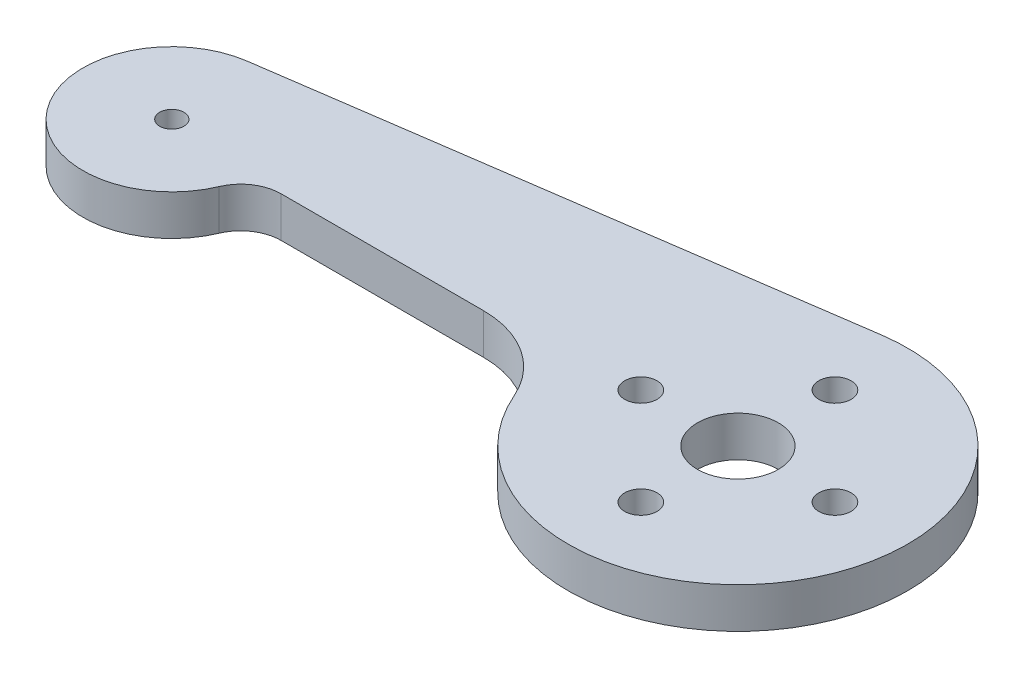
ISO-10303-21;
HEADER;
FILE_DESCRIPTION(('STEP AP214'),'2;1');
FILE_NAME('part.step','',(''),(''),'','','');
FILE_SCHEMA(('AUTOMOTIVE_DESIGN { 1 0 10303 214 1 1 1 1 }'));
ENDSEC;
DATA;
#1=APPLICATION_CONTEXT('core data for automotive mechanical design processes');
#2=APPLICATION_PROTOCOL_DEFINITION('international standard','automotive_design',2000,#1);
#3=PRODUCT_CONTEXT('',#1,'mechanical');
#4=PRODUCT('Part','Part','',(#3));
#5=PRODUCT_RELATED_PRODUCT_CATEGORY('part','',(#4));
#6=PRODUCT_DEFINITION_FORMATION('','',#4);
#7=PRODUCT_DEFINITION_CONTEXT('part definition',#1,'design');
#8=PRODUCT_DEFINITION('design','',#6,#7);
#9=PRODUCT_DEFINITION_SHAPE('','',#8);
#10=(LENGTH_UNIT() NAMED_UNIT(*) SI_UNIT(.MILLI.,.METRE.));
#11=(NAMED_UNIT(*) PLANE_ANGLE_UNIT() SI_UNIT($,.RADIAN.));
#12=(NAMED_UNIT(*) SI_UNIT($,.STERADIAN.) SOLID_ANGLE_UNIT());
#13=UNCERTAINTY_MEASURE_WITH_UNIT(LENGTH_MEASURE(1.E-05),#10,'distance_accuracy_value','');
#14=(GEOMETRIC_REPRESENTATION_CONTEXT(3) GLOBAL_UNCERTAINTY_ASSIGNED_CONTEXT((#13)) GLOBAL_UNIT_ASSIGNED_CONTEXT((#10,
#11,#12)) REPRESENTATION_CONTEXT('',''));
#15=CARTESIAN_POINT('',(0.,0.,0.));
#16=DIRECTION('',(0.,0.,1.));
#17=DIRECTION('',(1.,0.,0.));
#18=AXIS2_PLACEMENT_3D('',#15,#16,#17);
#19=CARTESIAN_POINT('',(0.,5.,0.));
#20=DIRECTION('',(0.,1.,0.));
#21=DIRECTION('',(0.,0.,1.));
#22=AXIS2_PLACEMENT_3D('',#19,#20,#21);
#23=PLANE('',#22);
#24=CARTESIAN_POINT('',(70.,5.,12.));
#25=DIRECTION('',(0.,1.,0.));
#26=DIRECTION('',(0.,0.,1.));
#27=AXIS2_PLACEMENT_3D('',#24,#25,#26);
#28=CIRCLE('',#27,2.);
#29=CARTESIAN_POINT('',(70.,5.,14.));
#30=VERTEX_POINT('',#29);
#31=EDGE_CURVE('E224',#30,#30,#28,.T.);
#32=ORIENTED_EDGE('',*,*,#31,.F.);
#33=EDGE_LOOP('',(#32));
#34=FACE_BOUND('',#33,.T.);
#35=CARTESIAN_POINT('',(70.,5.,-12.));
#36=DIRECTION('',(0.,1.,0.));
#37=DIRECTION('',(0.,0.,1.));
#38=AXIS2_PLACEMENT_3D('',#35,#36,#37);
#39=CIRCLE('',#38,2.);
#40=CARTESIAN_POINT('',(70.,5.,-10.));
#41=VERTEX_POINT('',#40);
#42=EDGE_CURVE('E240',#41,#41,#39,.T.);
#43=ORIENTED_EDGE('',*,*,#42,.F.);
#44=EDGE_LOOP('',(#43));
#45=FACE_BOUND('',#44,.T.);
#46=CARTESIAN_POINT('',(0.,5.,0.));
#47=DIRECTION('',(0.,1.,0.));
#48=DIRECTION('',(0.,0.,1.));
#49=AXIS2_PLACEMENT_3D('',#46,#47,#48);
#50=CIRCLE('',#49,1.5);
#51=CARTESIAN_POINT('',(0.,5.,1.5));
#52=VERTEX_POINT('',#51);
#53=EDGE_CURVE('E138',#52,#52,#50,.T.);
#54=ORIENTED_EDGE('',*,*,#53,.F.);
#55=EDGE_LOOP('',(#54));
#56=FACE_BOUND('',#55,.T.);
#57=CARTESIAN_POINT('',(0.,5.,0.));
#58=DIRECTION('',(0.,1.,0.));
#59=DIRECTION('',(0.,0.,1.));
#60=AXIS2_PLACEMENT_3D('',#57,#58,#59);
#61=CIRCLE('',#60,11.);
#62=CARTESIAN_POINT('',(-1.57142857142857,5.,-10.8871765047187));
#63=VERTEX_POINT('',#62);
#64=CARTESIAN_POINT('',(10.1347674446449,5.,4.27627043613554));
#65=VERTEX_POINT('',#64);
#66=EDGE_CURVE('E150',#63,#65,#61,.T.);
#67=ORIENTED_EDGE('',*,*,#66,.T.);
#68=CARTESIAN_POINT('',(14.7414799194834,5.,6.22002972528806));
#69=DIRECTION('',(0.,-1.,0.));
#70=DIRECTION('',(0.,0.,1.));
#71=AXIS2_PLACEMENT_3D('',#68,#69,#70);
#72=CIRCLE('',#71,5.);
#73=CARTESIAN_POINT('',(14.7414799194834,5.,1.22002972528806));
#74=VERTEX_POINT('',#73);
#75=EDGE_CURVE('E98',#65,#74,#72,.T.);
#76=ORIENTED_EDGE('',*,*,#75,.T.);
#77=DIRECTION('',(1.,0.,0.));
#78=VECTOR('',#77,1.);
#79=CARTESIAN_POINT('',(14.7414799194834,5.,1.22002972528806));
#80=LINE('',#79,#78);
#81=CARTESIAN_POINT('',(39.76375,5.,1.22002972528806));
#82=VERTEX_POINT('',#81);
#83=EDGE_CURVE('E111',#74,#82,#80,.T.);
#84=ORIENTED_EDGE('',*,*,#83,.T.);
#85=CARTESIAN_POINT('',(39.76375,5.,13.2200297252881));
#86=DIRECTION('',(0.,-1.,0.));
#87=DIRECTION('',(0.,0.,1.));
#88=AXIS2_PLACEMENT_3D('',#85,#86,#87);
#89=CIRCLE('',#88,12.);
#90=CARTESIAN_POINT('',(50.75875,5.,8.41274618881966));
#91=VERTEX_POINT('',#90);
#92=EDGE_CURVE('E105',#82,#91,#89,.T.);
#93=ORIENTED_EDGE('',*,*,#92,.T.);
#94=CARTESIAN_POINT('',(70.,5.,0.));
#95=DIRECTION('',(0.,1.,0.));
#96=DIRECTION('',(0.,0.,1.));
#97=AXIS2_PLACEMENT_3D('',#94,#95,#96);
#98=CIRCLE('',#97,21.);
#99=CARTESIAN_POINT('',(67.,5.,-20.7846096908265));
#100=VERTEX_POINT('',#99);
#101=EDGE_CURVE('E109',#91,#100,#98,.T.);
#102=ORIENTED_EDGE('',*,*,#101,.T.);
#103=DIRECTION('',(-0.989743318610787,0.,0.142857142857143));
#104=VECTOR('',#103,1.);
#105=CARTESIAN_POINT('',(-1.57142857142857,5.,-10.8871765047187));
#106=LINE('',#105,#104);
#107=EDGE_CURVE('E61',#100,#63,#106,.T.);
#108=ORIENTED_EDGE('',*,*,#107,.T.);
#109=EDGE_LOOP('',(#67,#76,#84,#93,#102,#108));
#110=FACE_BOUND('',#109,.T.);
#111=CARTESIAN_POINT('',(70.,5.,0.));
#112=DIRECTION('',(0.,1.,0.));
#113=DIRECTION('',(0.,0.,1.));
#114=AXIS2_PLACEMENT_3D('',#111,#112,#113);
#115=CIRCLE('',#114,5.);
#116=CARTESIAN_POINT('',(70.,5.,5.));
#117=VERTEX_POINT('',#116);
#118=EDGE_CURVE('E248',#117,#117,#115,.T.);
#119=ORIENTED_EDGE('',*,*,#118,.F.);
#120=EDGE_LOOP('',(#119));
#121=FACE_BOUND('',#120,.T.);
#122=CARTESIAN_POINT('',(82.,5.,0.));
#123=DIRECTION('',(0.,1.,0.));
#124=DIRECTION('',(0.,0.,1.));
#125=AXIS2_PLACEMENT_3D('',#122,#123,#124);
#126=CIRCLE('',#125,2.);
#127=CARTESIAN_POINT('',(82.,5.,2.));
#128=VERTEX_POINT('',#127);
#129=EDGE_CURVE('E232',#128,#128,#126,.T.);
#130=ORIENTED_EDGE('',*,*,#129,.F.);
#131=EDGE_LOOP('',(#130));
#132=FACE_BOUND('',#131,.T.);
#133=CARTESIAN_POINT('',(58.,5.,0.));
#134=DIRECTION('',(0.,1.,0.));
#135=DIRECTION('',(0.,0.,1.));
#136=AXIS2_PLACEMENT_3D('',#133,#134,#135);
#137=CIRCLE('',#136,2.00000000000001);
#138=CARTESIAN_POINT('',(58.,5.,2.00000000000001));
#139=VERTEX_POINT('',#138);
#140=EDGE_CURVE('E213',#139,#139,#137,.T.);
#141=ORIENTED_EDGE('',*,*,#140,.F.);
#142=EDGE_LOOP('',(#141));
#143=FACE_BOUND('',#142,.T.);
#144=ADVANCED_FACE('F43',(#34,#45,#56,#110,#121,#132,#143),#23,.T.);
#145=CARTESIAN_POINT('',(0.,0.,0.));
#146=DIRECTION('',(0.,1.,0.));
#147=DIRECTION('',(0.,0.,1.));
#148=AXIS2_PLACEMENT_3D('',#145,#146,#147);
#149=PLANE('',#148);
#150=CARTESIAN_POINT('',(0.,0.,0.));
#151=DIRECTION('',(0.,1.,0.));
#152=DIRECTION('',(0.,0.,1.));
#153=AXIS2_PLACEMENT_3D('',#150,#151,#152);
#154=CIRCLE('',#153,11.);
#155=CARTESIAN_POINT('',(-1.57142857142857,0.,-10.8871765047187));
#156=VERTEX_POINT('',#155);
#157=CARTESIAN_POINT('',(10.1347674446449,0.,4.27627043613554));
#158=VERTEX_POINT('',#157);
#159=EDGE_CURVE('E133',#156,#158,#154,.T.);
#160=ORIENTED_EDGE('',*,*,#159,.F.);
#161=DIRECTION('',(-0.989743318610787,0.,0.142857142857143));
#162=VECTOR('',#161,1.);
#163=CARTESIAN_POINT('',(-1.57142857142857,0.,-10.8871765047187));
#164=LINE('',#163,#162);
#165=CARTESIAN_POINT('',(67.,0.,-20.7846096908265));
#166=VERTEX_POINT('',#165);
#167=EDGE_CURVE('E90',#166,#156,#164,.T.);
#168=ORIENTED_EDGE('',*,*,#167,.F.);
#169=CARTESIAN_POINT('',(70.,0.,0.));
#170=DIRECTION('',(0.,1.,0.));
#171=DIRECTION('',(0.,0.,1.));
#172=AXIS2_PLACEMENT_3D('',#169,#170,#171);
#173=CIRCLE('',#172,21.);
#174=CARTESIAN_POINT('',(50.75875,0.,8.41274618881966));
#175=VERTEX_POINT('',#174);
#176=EDGE_CURVE('E84',#175,#166,#173,.T.);
#177=ORIENTED_EDGE('',*,*,#176,.F.);
#178=CARTESIAN_POINT('',(39.76375,0.,13.2200297252881));
#179=DIRECTION('',(0.,-1.,0.));
#180=DIRECTION('',(0.,0.,1.));
#181=AXIS2_PLACEMENT_3D('',#178,#179,#180);
#182=CIRCLE('',#181,12.);
#183=CARTESIAN_POINT('',(39.76375,0.,1.22002972528806));
#184=VERTEX_POINT('',#183);
#185=EDGE_CURVE('E120',#184,#175,#182,.T.);
#186=ORIENTED_EDGE('',*,*,#185,.F.);
#187=DIRECTION('',(1.,0.,0.));
#188=VECTOR('',#187,1.);
#189=CARTESIAN_POINT('',(14.7414799194834,0.,1.22002972528806));
#190=LINE('',#189,#188);
#191=CARTESIAN_POINT('',(14.7414799194834,0.,1.22002972528806));
#192=VERTEX_POINT('',#191);
#193=EDGE_CURVE('E141',#192,#184,#190,.T.);
#194=ORIENTED_EDGE('',*,*,#193,.F.);
#195=CARTESIAN_POINT('',(14.7414799194834,0.,6.22002972528806));
#196=DIRECTION('',(0.,-1.,0.));
#197=DIRECTION('',(0.,0.,1.));
#198=AXIS2_PLACEMENT_3D('',#195,#196,#197);
#199=CIRCLE('',#198,5.);
#200=EDGE_CURVE('E137',#158,#192,#199,.T.);
#201=ORIENTED_EDGE('',*,*,#200,.F.);
#202=EDGE_LOOP('',(#160,#168,#177,#186,#194,#201));
#203=FACE_BOUND('',#202,.T.);
#204=CARTESIAN_POINT('',(0.,0.,0.));
#205=DIRECTION('',(0.,1.,0.));
#206=DIRECTION('',(0.,0.,1.));
#207=AXIS2_PLACEMENT_3D('',#204,#205,#206);
#208=CIRCLE('',#207,1.5);
#209=CARTESIAN_POINT('',(0.,0.,1.5));
#210=VERTEX_POINT('',#209);
#211=EDGE_CURVE('E252',#210,#210,#208,.T.);
#212=ORIENTED_EDGE('',*,*,#211,.T.);
#213=EDGE_LOOP('',(#212));
#214=FACE_BOUND('',#213,.T.);
#215=CARTESIAN_POINT('',(70.,0.,0.));
#216=DIRECTION('',(0.,1.,0.));
#217=DIRECTION('',(0.,0.,1.));
#218=AXIS2_PLACEMENT_3D('',#215,#216,#217);
#219=CIRCLE('',#218,5.);
#220=CARTESIAN_POINT('',(70.,0.,5.));
#221=VERTEX_POINT('',#220);
#222=EDGE_CURVE('E244',#221,#221,#219,.T.);
#223=ORIENTED_EDGE('',*,*,#222,.T.);
#224=EDGE_LOOP('',(#223));
#225=FACE_BOUND('',#224,.T.);
#226=CARTESIAN_POINT('',(70.,0.,-12.));
#227=DIRECTION('',(0.,1.,0.));
#228=DIRECTION('',(0.,0.,1.));
#229=AXIS2_PLACEMENT_3D('',#226,#227,#228);
#230=CIRCLE('',#229,2.);
#231=CARTESIAN_POINT('',(70.,0.,-10.));
#232=VERTEX_POINT('',#231);
#233=EDGE_CURVE('E236',#232,#232,#230,.T.);
#234=ORIENTED_EDGE('',*,*,#233,.T.);
#235=EDGE_LOOP('',(#234));
#236=FACE_BOUND('',#235,.T.);
#237=CARTESIAN_POINT('',(82.,0.,0.));
#238=DIRECTION('',(0.,1.,0.));
#239=DIRECTION('',(0.,0.,1.));
#240=AXIS2_PLACEMENT_3D('',#237,#238,#239);
#241=CIRCLE('',#240,2.);
#242=CARTESIAN_POINT('',(82.,0.,2.));
#243=VERTEX_POINT('',#242);
#244=EDGE_CURVE('E228',#243,#243,#241,.T.);
#245=ORIENTED_EDGE('',*,*,#244,.T.);
#246=EDGE_LOOP('',(#245));
#247=FACE_BOUND('',#246,.T.);
#248=CARTESIAN_POINT('',(70.,0.,12.));
#249=DIRECTION('',(0.,1.,0.));
#250=DIRECTION('',(0.,0.,1.));
#251=AXIS2_PLACEMENT_3D('',#248,#249,#250);
#252=CIRCLE('',#251,2.);
#253=CARTESIAN_POINT('',(70.,0.,14.));
#254=VERTEX_POINT('',#253);
#255=EDGE_CURVE('E221',#254,#254,#252,.T.);
#256=ORIENTED_EDGE('',*,*,#255,.T.);
#257=EDGE_LOOP('',(#256));
#258=FACE_BOUND('',#257,.T.);
#259=CARTESIAN_POINT('',(58.,0.,0.));
#260=DIRECTION('',(0.,1.,0.));
#261=DIRECTION('',(0.,0.,1.));
#262=AXIS2_PLACEMENT_3D('',#259,#260,#261);
#263=CIRCLE('',#262,2.00000000000001);
#264=CARTESIAN_POINT('',(58.,0.,2.00000000000001));
#265=VERTEX_POINT('',#264);
#266=EDGE_CURVE('E216',#265,#265,#263,.T.);
#267=ORIENTED_EDGE('',*,*,#266,.T.);
#268=EDGE_LOOP('',(#267));
#269=FACE_BOUND('',#268,.T.);
#270=ADVANCED_FACE('F163',(#203,#214,#225,#236,#247,#258,#269),#149,.F.);
#271=CARTESIAN_POINT('',(0.,5.,0.));
#272=DIRECTION('',(0.,-1.,0.));
#273=DIRECTION('',(0.,0.,-1.));
#274=AXIS2_PLACEMENT_3D('',#271,#272,#273);
#275=CYLINDRICAL_SURFACE('',#274,11.);
#276=ORIENTED_EDGE('',*,*,#159,.T.);
#277=DIRECTION('',(0.,-1.,0.));
#278=VECTOR('',#277,1.);
#279=CARTESIAN_POINT('',(10.1347674446449,5.,4.27627043613554));
#280=LINE('',#279,#278);
#281=EDGE_CURVE('E11',#65,#158,#280,.T.);
#282=ORIENTED_EDGE('',*,*,#281,.F.);
#283=ORIENTED_EDGE('',*,*,#66,.F.);
#284=DIRECTION('',(0.,-1.,0.));
#285=VECTOR('',#284,1.);
#286=CARTESIAN_POINT('',(-1.57142857142857,5.,-10.8871765047187));
#287=LINE('',#286,#285);
#288=EDGE_CURVE('E129',#63,#156,#287,.T.);
#289=ORIENTED_EDGE('',*,*,#288,.T.);
#290=EDGE_LOOP('',(#276,#282,#283,#289));
#291=FACE_BOUND('',#290,.T.);
#292=ADVANCED_FACE('F45',(#291),#275,.T.);
#293=CARTESIAN_POINT('',(14.7414799194834,5.,6.22002972528806));
#294=DIRECTION('',(0.,-1.,0.));
#295=DIRECTION('',(0.,0.,-1.));
#296=AXIS2_PLACEMENT_3D('',#293,#294,#295);
#297=CYLINDRICAL_SURFACE('',#296,5.);
#298=ORIENTED_EDGE('',*,*,#200,.T.);
#299=DIRECTION('',(0.,-1.,0.));
#300=VECTOR('',#299,1.);
#301=CARTESIAN_POINT('',(14.7414799194834,5.,1.22002972528806));
#302=LINE('',#301,#300);
#303=EDGE_CURVE('E53',#74,#192,#302,.T.);
#304=ORIENTED_EDGE('',*,*,#303,.F.);
#305=ORIENTED_EDGE('',*,*,#75,.F.);
#306=ORIENTED_EDGE('',*,*,#281,.T.);
#307=EDGE_LOOP('',(#298,#304,#305,#306));
#308=FACE_BOUND('',#307,.T.);
#309=ADVANCED_FACE('F338',(#308),#297,.F.);
#310=CARTESIAN_POINT('',(14.7414799194834,5.,1.22002972528806));
#311=DIRECTION('',(0.,0.,-1.));
#312=DIRECTION('',(-1.,0.,0.));
#313=AXIS2_PLACEMENT_3D('',#310,#311,#312);
#314=PLANE('',#313);
#315=ORIENTED_EDGE('',*,*,#193,.T.);
#316=DIRECTION('',(0.,-1.,0.));
#317=VECTOR('',#316,1.);
#318=CARTESIAN_POINT('',(39.76375,5.,1.22002972528806));
#319=LINE('',#318,#317);
#320=EDGE_CURVE('E122',#82,#184,#319,.T.);
#321=ORIENTED_EDGE('',*,*,#320,.F.);
#322=ORIENTED_EDGE('',*,*,#83,.F.);
#323=ORIENTED_EDGE('',*,*,#303,.T.);
#324=EDGE_LOOP('',(#315,#321,#322,#323));
#325=FACE_BOUND('',#324,.T.);
#326=ADVANCED_FACE('F160',(#325),#314,.F.);
#327=CARTESIAN_POINT('',(39.76375,5.,13.2200297252881));
#328=DIRECTION('',(0.,-1.,0.));
#329=DIRECTION('',(0.,0.,-1.));
#330=AXIS2_PLACEMENT_3D('',#327,#328,#329);
#331=CYLINDRICAL_SURFACE('',#330,12.);
#332=ORIENTED_EDGE('',*,*,#185,.T.);
#333=DIRECTION('',(0.,-1.,0.));
#334=VECTOR('',#333,1.);
#335=CARTESIAN_POINT('',(50.75875,5.,8.41274618881966));
#336=LINE('',#335,#334);
#337=EDGE_CURVE('E117',#91,#175,#336,.T.);
#338=ORIENTED_EDGE('',*,*,#337,.F.);
#339=ORIENTED_EDGE('',*,*,#92,.F.);
#340=ORIENTED_EDGE('',*,*,#320,.T.);
#341=EDGE_LOOP('',(#332,#338,#339,#340));
#342=FACE_BOUND('',#341,.T.);
#343=ADVANCED_FACE('F118',(#342),#331,.F.);
#344=CARTESIAN_POINT('',(70.,5.,0.));
#345=DIRECTION('',(0.,-1.,0.));
#346=DIRECTION('',(0.,0.,-1.));
#347=AXIS2_PLACEMENT_3D('',#344,#345,#346);
#348=CYLINDRICAL_SURFACE('',#347,21.);
#349=ORIENTED_EDGE('',*,*,#176,.T.);
#350=DIRECTION('',(0.,-1.,0.));
#351=VECTOR('',#350,1.);
#352=CARTESIAN_POINT('',(67.,5.,-20.7846096908265));
#353=LINE('',#352,#351);
#354=EDGE_CURVE('E123',#100,#166,#353,.T.);
#355=ORIENTED_EDGE('',*,*,#354,.F.);
#356=ORIENTED_EDGE('',*,*,#101,.F.);
#357=ORIENTED_EDGE('',*,*,#337,.T.);
#358=EDGE_LOOP('',(#349,#355,#356,#357));
#359=FACE_BOUND('',#358,.T.);
#360=ADVANCED_FACE('F125',(#359),#348,.T.);
#361=CARTESIAN_POINT('',(-1.57142857142857,5.,-10.8871765047187));
#362=DIRECTION('',(0.142857142857143,0.,0.989743318610787));
#363=DIRECTION('',(0.989743318610787,0.,-0.142857142857143));
#364=AXIS2_PLACEMENT_3D('',#361,#362,#363);
#365=PLANE('',#364);
#366=ORIENTED_EDGE('',*,*,#167,.T.);
#367=ORIENTED_EDGE('',*,*,#288,.F.);
#368=ORIENTED_EDGE('',*,*,#107,.F.);
#369=ORIENTED_EDGE('',*,*,#354,.T.);
#370=EDGE_LOOP('',(#366,#367,#368,#369));
#371=FACE_BOUND('',#370,.T.);
#372=ADVANCED_FACE('F168',(#371),#365,.F.);
#373=CARTESIAN_POINT('',(0.,5.,0.));
#374=DIRECTION('',(0.,-1.,0.));
#375=DIRECTION('',(0.,0.,-1.));
#376=AXIS2_PLACEMENT_3D('',#373,#374,#375);
#377=CYLINDRICAL_SURFACE('',#376,1.5);
#378=ORIENTED_EDGE('',*,*,#53,.T.);
#379=EDGE_LOOP('',(#378));
#380=FACE_BOUND('',#379,.T.);
#381=ORIENTED_EDGE('',*,*,#211,.F.);
#382=EDGE_LOOP('',(#381));
#383=FACE_BOUND('',#382,.T.);
#384=ADVANCED_FACE('F170',(#380,#383),#377,.F.);
#385=CARTESIAN_POINT('',(70.,5.,0.));
#386=DIRECTION('',(0.,-1.,0.));
#387=DIRECTION('',(0.,0.,-1.));
#388=AXIS2_PLACEMENT_3D('',#385,#386,#387);
#389=CYLINDRICAL_SURFACE('',#388,5.);
#390=ORIENTED_EDGE('',*,*,#118,.T.);
#391=EDGE_LOOP('',(#390));
#392=FACE_BOUND('',#391,.T.);
#393=ORIENTED_EDGE('',*,*,#222,.F.);
#394=EDGE_LOOP('',(#393));
#395=FACE_BOUND('',#394,.T.);
#396=ADVANCED_FACE('F176',(#392,#395),#389,.F.);
#397=CARTESIAN_POINT('',(70.,5.,-12.));
#398=DIRECTION('',(0.,-1.,0.));
#399=DIRECTION('',(0.,0.,-1.));
#400=AXIS2_PLACEMENT_3D('',#397,#398,#399);
#401=CYLINDRICAL_SURFACE('',#400,2.);
#402=ORIENTED_EDGE('',*,*,#42,.T.);
#403=EDGE_LOOP('',(#402));
#404=FACE_BOUND('',#403,.T.);
#405=ORIENTED_EDGE('',*,*,#233,.F.);
#406=EDGE_LOOP('',(#405));
#407=FACE_BOUND('',#406,.T.);
#408=ADVANCED_FACE('F192',(#404,#407),#401,.F.);
#409=CARTESIAN_POINT('',(82.,5.,0.));
#410=DIRECTION('',(0.,-1.,0.));
#411=DIRECTION('',(0.,0.,-1.));
#412=AXIS2_PLACEMENT_3D('',#409,#410,#411);
#413=CYLINDRICAL_SURFACE('',#412,2.);
#414=ORIENTED_EDGE('',*,*,#129,.T.);
#415=EDGE_LOOP('',(#414));
#416=FACE_BOUND('',#415,.T.);
#417=ORIENTED_EDGE('',*,*,#244,.F.);
#418=EDGE_LOOP('',(#417));
#419=FACE_BOUND('',#418,.T.);
#420=ADVANCED_FACE('F196',(#416,#419),#413,.F.);
#421=CARTESIAN_POINT('',(70.,5.,12.));
#422=DIRECTION('',(0.,-1.,0.));
#423=DIRECTION('',(0.,0.,-1.));
#424=AXIS2_PLACEMENT_3D('',#421,#422,#423);
#425=CYLINDRICAL_SURFACE('',#424,2.);
#426=ORIENTED_EDGE('',*,*,#31,.T.);
#427=EDGE_LOOP('',(#426));
#428=FACE_BOUND('',#427,.T.);
#429=ORIENTED_EDGE('',*,*,#255,.F.);
#430=EDGE_LOOP('',(#429));
#431=FACE_BOUND('',#430,.T.);
#432=ADVANCED_FACE('F200',(#428,#431),#425,.F.);
#433=CARTESIAN_POINT('',(58.,5.,0.));
#434=DIRECTION('',(0.,-1.,0.));
#435=DIRECTION('',(0.,0.,-1.));
#436=AXIS2_PLACEMENT_3D('',#433,#434,#435);
#437=CYLINDRICAL_SURFACE('',#436,2.00000000000001);
#438=ORIENTED_EDGE('',*,*,#140,.T.);
#439=EDGE_LOOP('',(#438));
#440=FACE_BOUND('',#439,.T.);
#441=ORIENTED_EDGE('',*,*,#266,.F.);
#442=EDGE_LOOP('',(#441));
#443=FACE_BOUND('',#442,.T.);
#444=ADVANCED_FACE('F204',(#440,#443),#437,.F.);
#445=CLOSED_SHELL('',(#144,#270,#292,#309,#326,#343,#360,#372,#384,#396,#408,#420,#432,#444));
#446=MANIFOLD_SOLID_BREP('B2',#445);
#447=ADVANCED_BREP_SHAPE_REPRESENTATION('',(#18,#446),#14);
#448=SHAPE_DEFINITION_REPRESENTATION(#9,#447);
ENDSEC;
END-ISO-10303-21;
